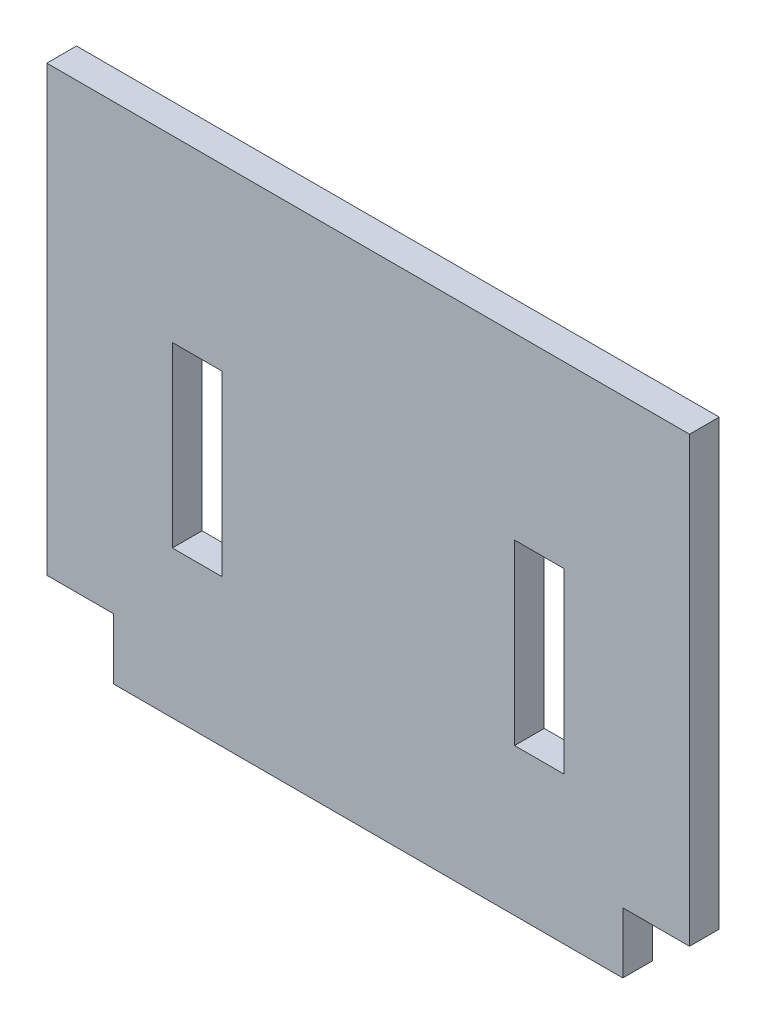
ISO-10303-21;
HEADER;
FILE_DESCRIPTION(('STEP AP214'),'2;1');
FILE_NAME('part.step','',(''),(''),'','','');
FILE_SCHEMA(('AUTOMOTIVE_DESIGN { 1 0 10303 214 1 1 1 1 }'));
ENDSEC;
DATA;
#1=APPLICATION_CONTEXT('core data for automotive mechanical design processes');
#2=APPLICATION_PROTOCOL_DEFINITION('international standard','automotive_design',2000,#1);
#3=PRODUCT_CONTEXT('',#1,'mechanical');
#4=PRODUCT('Part','Part','',(#3));
#5=PRODUCT_RELATED_PRODUCT_CATEGORY('part','',(#4));
#6=PRODUCT_DEFINITION_FORMATION('','',#4);
#7=PRODUCT_DEFINITION_CONTEXT('part definition',#1,'design');
#8=PRODUCT_DEFINITION('design','',#6,#7);
#9=PRODUCT_DEFINITION_SHAPE('','',#8);
#10=(LENGTH_UNIT() NAMED_UNIT(*) SI_UNIT(.MILLI.,.METRE.));
#11=(NAMED_UNIT(*) PLANE_ANGLE_UNIT() SI_UNIT($,.RADIAN.));
#12=(NAMED_UNIT(*) SI_UNIT($,.STERADIAN.) SOLID_ANGLE_UNIT());
#13=UNCERTAINTY_MEASURE_WITH_UNIT(LENGTH_MEASURE(1.E-05),#10,'distance_accuracy_value','');
#14=(GEOMETRIC_REPRESENTATION_CONTEXT(3) GLOBAL_UNCERTAINTY_ASSIGNED_CONTEXT((#13)) GLOBAL_UNIT_ASSIGNED_CONTEXT((#10,
#11,#12)) REPRESENTATION_CONTEXT('',''));
#15=CARTESIAN_POINT('',(0.,0.,0.));
#16=DIRECTION('',(0.,0.,1.));
#17=DIRECTION('',(1.,0.,0.));
#18=AXIS2_PLACEMENT_3D('',#15,#16,#17);
#19=CARTESIAN_POINT('',(-776.713414634147,983.740243902439,3.));
#20=DIRECTION('',(1.,0.,0.));
#21=DIRECTION('',(0.,0.,-1.));
#22=AXIS2_PLACEMENT_3D('',#19,#20,#21);
#23=PLANE('',#22);
#24=DIRECTION('',(0.,-1.,0.));
#25=VECTOR('',#24,1.);
#26=CARTESIAN_POINT('',(-776.713414634147,983.740243902439,0.));
#27=LINE('',#26,#25);
#28=CARTESIAN_POINT('',(-776.713414634147,1034.74024390244,0.));
#29=VERTEX_POINT('',#28);
#30=CARTESIAN_POINT('',(-776.713414634147,989.890243902439,0.));
#31=VERTEX_POINT('',#30);
#32=EDGE_CURVE('E269',#29,#31,#27,.T.);
#33=ORIENTED_EDGE('',*,*,#32,.T.);
#34=DIRECTION('',(0.,0.,1.));
#35=VECTOR('',#34,1.);
#36=CARTESIAN_POINT('',(-776.713414634147,989.890243902439,0.));
#37=LINE('',#36,#35);
#38=CARTESIAN_POINT('',(-776.713414634147,989.890243902439,3.));
#39=VERTEX_POINT('',#38);
#40=EDGE_CURVE('E265',#31,#39,#37,.T.);
#41=ORIENTED_EDGE('',*,*,#40,.T.);
#42=DIRECTION('',(0.,-1.,0.));
#43=VECTOR('',#42,1.);
#44=CARTESIAN_POINT('',(-776.713414634147,983.740243902439,3.));
#45=LINE('',#44,#43);
#46=CARTESIAN_POINT('',(-776.713414634147,1034.74024390244,3.));
#47=VERTEX_POINT('',#46);
#48=EDGE_CURVE('E298',#47,#39,#45,.T.);
#49=ORIENTED_EDGE('',*,*,#48,.F.);
#50=DIRECTION('',(0.,0.,-1.));
#51=VECTOR('',#50,1.);
#52=CARTESIAN_POINT('',(-776.713414634147,1034.74024390244,3.));
#53=LINE('',#52,#51);
#54=EDGE_CURVE('E51',#47,#29,#53,.T.);
#55=ORIENTED_EDGE('',*,*,#54,.T.);
#56=EDGE_LOOP('',(#33,#41,#49,#55));
#57=FACE_BOUND('',#56,.T.);
#58=ADVANCED_FACE('F43',(#57),#23,.F.);
#59=CARTESIAN_POINT('',(-776.713414634147,983.740243902439,3.));
#60=DIRECTION('',(0.,1.,0.));
#61=DIRECTION('',(-1.,0.,0.));
#62=AXIS2_PLACEMENT_3D('',#59,#60,#61);
#63=PLANE('',#62);
#64=DIRECTION('',(1.,0.,0.));
#65=VECTOR('',#64,1.);
#66=CARTESIAN_POINT('',(-776.713414634147,983.740243902439,3.));
#67=LINE('',#66,#65);
#68=CARTESIAN_POINT('',(-769.963414634146,983.740243902439,3.));
#69=VERTEX_POINT('',#68);
#70=CARTESIAN_POINT('',(-718.463414634147,983.740243902439,3.));
#71=VERTEX_POINT('',#70);
#72=EDGE_CURVE('E302',#69,#71,#67,.T.);
#73=ORIENTED_EDGE('',*,*,#72,.F.);
#74=DIRECTION('',(0.,0.,1.));
#75=VECTOR('',#74,1.);
#76=CARTESIAN_POINT('',(-769.963414634146,983.740243902439,0.));
#77=LINE('',#76,#75);
#78=CARTESIAN_POINT('',(-769.963414634146,983.740243902439,0.));
#79=VERTEX_POINT('',#78);
#80=EDGE_CURVE('E257',#79,#69,#77,.T.);
#81=ORIENTED_EDGE('',*,*,#80,.F.);
#82=DIRECTION('',(1.,0.,0.));
#83=VECTOR('',#82,1.);
#84=CARTESIAN_POINT('',(-776.713414634147,983.740243902439,0.));
#85=LINE('',#84,#83);
#86=CARTESIAN_POINT('',(-718.463414634147,983.740243902439,0.));
#87=VERTEX_POINT('',#86);
#88=EDGE_CURVE('E316',#79,#87,#85,.T.);
#89=ORIENTED_EDGE('',*,*,#88,.T.);
#90=DIRECTION('',(0.,0.,1.));
#91=VECTOR('',#90,1.);
#92=CARTESIAN_POINT('',(-718.463414634147,983.740243902439,0.));
#93=LINE('',#92,#91);
#94=EDGE_CURVE('E202',#87,#71,#93,.T.);
#95=ORIENTED_EDGE('',*,*,#94,.T.);
#96=EDGE_LOOP('',(#73,#81,#89,#95));
#97=FACE_BOUND('',#96,.T.);
#98=ADVANCED_FACE('F361',(#97),#63,.F.);
#99=CARTESIAN_POINT('',(-711.713414634147,983.740243902439,3.));
#100=DIRECTION('',(-1.,0.,0.));
#101=DIRECTION('',(0.,0.,1.));
#102=AXIS2_PLACEMENT_3D('',#99,#100,#101);
#103=PLANE('',#102);
#104=DIRECTION('',(0.,1.,0.));
#105=VECTOR('',#104,1.);
#106=CARTESIAN_POINT('',(-711.713414634147,983.740243902439,3.));
#107=LINE('',#106,#105);
#108=CARTESIAN_POINT('',(-711.713414634147,989.890243902439,3.));
#109=VERTEX_POINT('',#108);
#110=CARTESIAN_POINT('',(-711.713414634147,1034.74024390244,3.));
#111=VERTEX_POINT('',#110);
#112=EDGE_CURVE('E307',#109,#111,#107,.T.);
#113=ORIENTED_EDGE('',*,*,#112,.F.);
#114=DIRECTION('',(0.,0.,1.));
#115=VECTOR('',#114,1.);
#116=CARTESIAN_POINT('',(-711.713414634147,989.890243902439,0.));
#117=LINE('',#116,#115);
#118=CARTESIAN_POINT('',(-711.713414634147,989.890243902439,0.));
#119=VERTEX_POINT('',#118);
#120=EDGE_CURVE('E275',#119,#109,#117,.T.);
#121=ORIENTED_EDGE('',*,*,#120,.F.);
#122=DIRECTION('',(0.,1.,0.));
#123=VECTOR('',#122,1.);
#124=CARTESIAN_POINT('',(-711.713414634147,983.740243902439,0.));
#125=LINE('',#124,#123);
#126=CARTESIAN_POINT('',(-711.713414634147,1034.74024390244,0.));
#127=VERTEX_POINT('',#126);
#128=EDGE_CURVE('E320',#119,#127,#125,.T.);
#129=ORIENTED_EDGE('',*,*,#128,.T.);
#130=DIRECTION('',(0.,0.,-1.));
#131=VECTOR('',#130,1.);
#132=CARTESIAN_POINT('',(-711.713414634147,1034.74024390244,3.));
#133=LINE('',#132,#131);
#134=EDGE_CURVE('E11',#111,#127,#133,.T.);
#135=ORIENTED_EDGE('',*,*,#134,.F.);
#136=EDGE_LOOP('',(#113,#121,#129,#135));
#137=FACE_BOUND('',#136,.T.);
#138=ADVANCED_FACE('F352',(#137),#103,.F.);
#139=CARTESIAN_POINT('',(-776.713414634147,1034.74024390244,3.));
#140=DIRECTION('',(0.,-1.,0.));
#141=DIRECTION('',(0.,0.,-1.));
#142=AXIS2_PLACEMENT_3D('',#139,#140,#141);
#143=PLANE('',#142);
#144=DIRECTION('',(-1.,0.,0.));
#145=VECTOR('',#144,1.);
#146=CARTESIAN_POINT('',(-776.713414634147,1034.74024390244,0.));
#147=LINE('',#146,#145);
#148=EDGE_CURVE('E303',#127,#29,#147,.T.);
#149=ORIENTED_EDGE('',*,*,#148,.T.);
#150=ORIENTED_EDGE('',*,*,#54,.F.);
#151=DIRECTION('',(-1.,0.,0.));
#152=VECTOR('',#151,1.);
#153=CARTESIAN_POINT('',(-776.713414634147,1034.74024390244,3.));
#154=LINE('',#153,#152);
#155=EDGE_CURVE('E310',#111,#47,#154,.T.);
#156=ORIENTED_EDGE('',*,*,#155,.F.);
#157=ORIENTED_EDGE('',*,*,#134,.T.);
#158=EDGE_LOOP('',(#149,#150,#156,#157));
#159=FACE_BOUND('',#158,.T.);
#160=ADVANCED_FACE('F350',(#159),#143,.F.);
#161=CARTESIAN_POINT('',(0.,0.,3.));
#162=DIRECTION('',(0.,0.,-1.));
#163=DIRECTION('',(-1.,0.,0.));
#164=AXIS2_PLACEMENT_3D('',#161,#162,#163);
#165=PLANE('',#164);
#166=DIRECTION('',(-1.,0.,0.));
#167=VECTOR('',#166,1.);
#168=CARTESIAN_POINT('',(0.,1016.62491856167,3.));
#169=LINE('',#168,#167);
#170=CARTESIAN_POINT('',(-759.016384974895,1016.62491856167,3.));
#171=VERTEX_POINT('',#170);
#172=CARTESIAN_POINT('',(-764.016384974895,1016.62491856167,3.));
#173=VERTEX_POINT('',#172);
#174=EDGE_CURVE('E192',#171,#173,#169,.T.);
#175=ORIENTED_EDGE('',*,*,#174,.F.);
#176=DIRECTION('',(0.,1.,0.));
#177=VECTOR('',#176,1.);
#178=CARTESIAN_POINT('',(-759.016384974895,0.,3.));
#179=LINE('',#178,#177);
#180=CARTESIAN_POINT('',(-759.016384974895,998.624918561674,3.));
#181=VERTEX_POINT('',#180);
#182=EDGE_CURVE('E58',#181,#171,#179,.T.);
#183=ORIENTED_EDGE('',*,*,#182,.F.);
#184=DIRECTION('',(-1.,0.,0.));
#185=VECTOR('',#184,1.);
#186=CARTESIAN_POINT('',(0.,998.624918561674,3.));
#187=LINE('',#186,#185);
#188=CARTESIAN_POINT('',(-764.016384974895,998.624918561674,3.));
#189=VERTEX_POINT('',#188);
#190=EDGE_CURVE('E179',#181,#189,#187,.T.);
#191=ORIENTED_EDGE('',*,*,#190,.T.);
#192=DIRECTION('',(0.,1.,0.));
#193=VECTOR('',#192,1.);
#194=CARTESIAN_POINT('',(-764.016384974895,0.,3.));
#195=LINE('',#194,#193);
#196=EDGE_CURVE('E183',#189,#173,#195,.T.);
#197=ORIENTED_EDGE('',*,*,#196,.T.);
#198=EDGE_LOOP('',(#175,#183,#191,#197));
#199=FACE_BOUND('',#198,.T.);
#200=DIRECTION('',(0.,1.,0.));
#201=VECTOR('',#200,1.);
#202=CARTESIAN_POINT('',(-724.410444293397,0.,3.));
#203=LINE('',#202,#201);
#204=CARTESIAN_POINT('',(-724.410444293397,998.624918561675,3.));
#205=VERTEX_POINT('',#204);
#206=CARTESIAN_POINT('',(-724.410444293397,1016.62491856167,3.));
#207=VERTEX_POINT('',#206);
#208=EDGE_CURVE('E227',#205,#207,#203,.T.);
#209=ORIENTED_EDGE('',*,*,#208,.F.);
#210=DIRECTION('',(1.,0.,0.));
#211=VECTOR('',#210,1.);
#212=CARTESIAN_POINT('',(0.,998.624918561675,3.));
#213=LINE('',#212,#211);
#214=CARTESIAN_POINT('',(-729.410444293397,998.624918561675,3.));
#215=VERTEX_POINT('',#214);
#216=EDGE_CURVE('E66',#215,#205,#213,.T.);
#217=ORIENTED_EDGE('',*,*,#216,.F.);
#218=DIRECTION('',(0.,1.,0.));
#219=VECTOR('',#218,1.);
#220=CARTESIAN_POINT('',(-729.410444293397,0.,3.));
#221=LINE('',#220,#219);
#222=CARTESIAN_POINT('',(-729.410444293397,1016.62491856167,3.));
#223=VERTEX_POINT('',#222);
#224=EDGE_CURVE('E213',#215,#223,#221,.T.);
#225=ORIENTED_EDGE('',*,*,#224,.T.);
#226=DIRECTION('',(1.,0.,0.));
#227=VECTOR('',#226,1.);
#228=CARTESIAN_POINT('',(0.,1016.62491856167,3.));
#229=LINE('',#228,#227);
#230=EDGE_CURVE('E231',#223,#207,#229,.T.);
#231=ORIENTED_EDGE('',*,*,#230,.T.);
#232=EDGE_LOOP('',(#209,#217,#225,#231));
#233=FACE_BOUND('',#232,.T.);
#234=ORIENTED_EDGE('',*,*,#48,.T.);
#235=DIRECTION('',(-1.,0.,0.));
#236=VECTOR('',#235,1.);
#237=CARTESIAN_POINT('',(-776.713414634147,989.890243902439,3.));
#238=LINE('',#237,#236);
#239=CARTESIAN_POINT('',(-769.963414634146,989.890243902439,3.));
#240=VERTEX_POINT('',#239);
#241=EDGE_CURVE('E253',#240,#39,#238,.T.);
#242=ORIENTED_EDGE('',*,*,#241,.F.);
#243=DIRECTION('',(0.,1.,0.));
#244=VECTOR('',#243,1.);
#245=CARTESIAN_POINT('',(-769.963414634146,983.740243902439,3.));
#246=LINE('',#245,#244);
#247=EDGE_CURVE('E258',#69,#240,#246,.T.);
#248=ORIENTED_EDGE('',*,*,#247,.F.);
#249=ORIENTED_EDGE('',*,*,#72,.T.);
#250=DIRECTION('',(0.,-1.,0.));
#251=VECTOR('',#250,1.);
#252=CARTESIAN_POINT('',(-718.463414634147,983.740243902439,3.));
#253=LINE('',#252,#251);
#254=CARTESIAN_POINT('',(-718.463414634147,989.890243902439,3.));
#255=VERTEX_POINT('',#254);
#256=EDGE_CURVE('E285',#255,#71,#253,.T.);
#257=ORIENTED_EDGE('',*,*,#256,.F.);
#258=DIRECTION('',(-1.,0.,0.));
#259=VECTOR('',#258,1.);
#260=CARTESIAN_POINT('',(-711.713414634147,989.890243902439,3.));
#261=LINE('',#260,#259);
#262=EDGE_CURVE('E262',#109,#255,#261,.T.);
#263=ORIENTED_EDGE('',*,*,#262,.F.);
#264=ORIENTED_EDGE('',*,*,#112,.T.);
#265=ORIENTED_EDGE('',*,*,#155,.T.);
#266=EDGE_LOOP('',(#234,#242,#248,#249,#257,#263,#264,#265));
#267=FACE_BOUND('',#266,.T.);
#268=ADVANCED_FACE('F346',(#199,#233,#267),#165,.F.);
#269=CARTESIAN_POINT('',(0.,0.,0.));
#270=DIRECTION('',(0.,0.,-1.));
#271=DIRECTION('',(-1.,0.,0.));
#272=AXIS2_PLACEMENT_3D('',#269,#270,#271);
#273=PLANE('',#272);
#274=DIRECTION('',(0.,1.,0.));
#275=VECTOR('',#274,1.);
#276=CARTESIAN_POINT('',(-759.016384974895,0.,0.));
#277=LINE('',#276,#275);
#278=CARTESIAN_POINT('',(-759.016384974895,998.624918561674,0.));
#279=VERTEX_POINT('',#278);
#280=CARTESIAN_POINT('',(-759.016384974895,1016.62491856167,0.));
#281=VERTEX_POINT('',#280);
#282=EDGE_CURVE('E158',#279,#281,#277,.T.);
#283=ORIENTED_EDGE('',*,*,#282,.T.);
#284=DIRECTION('',(-1.,0.,0.));
#285=VECTOR('',#284,1.);
#286=CARTESIAN_POINT('',(0.,1016.62491856167,0.));
#287=LINE('',#286,#285);
#288=CARTESIAN_POINT('',(-764.016384974895,1016.62491856167,0.));
#289=VERTEX_POINT('',#288);
#290=EDGE_CURVE('E168',#281,#289,#287,.T.);
#291=ORIENTED_EDGE('',*,*,#290,.T.);
#292=DIRECTION('',(0.,1.,0.));
#293=VECTOR('',#292,1.);
#294=CARTESIAN_POINT('',(-764.016384974895,0.,0.));
#295=LINE('',#294,#293);
#296=CARTESIAN_POINT('',(-764.016384974895,998.624918561674,0.));
#297=VERTEX_POINT('',#296);
#298=EDGE_CURVE('E174',#297,#289,#295,.T.);
#299=ORIENTED_EDGE('',*,*,#298,.F.);
#300=DIRECTION('',(-1.,0.,0.));
#301=VECTOR('',#300,1.);
#302=CARTESIAN_POINT('',(0.,998.624918561674,0.));
#303=LINE('',#302,#301);
#304=EDGE_CURVE('E165',#279,#297,#303,.T.);
#305=ORIENTED_EDGE('',*,*,#304,.F.);
#306=EDGE_LOOP('',(#283,#291,#299,#305));
#307=FACE_BOUND('',#306,.T.);
#308=DIRECTION('',(1.,0.,0.));
#309=VECTOR('',#308,1.);
#310=CARTESIAN_POINT('',(0.,998.624918561675,0.));
#311=LINE('',#310,#309);
#312=CARTESIAN_POINT('',(-729.410444293397,998.624918561675,0.));
#313=VERTEX_POINT('',#312);
#314=CARTESIAN_POINT('',(-724.410444293397,998.624918561675,0.));
#315=VERTEX_POINT('',#314);
#316=EDGE_CURVE('E208',#313,#315,#311,.T.);
#317=ORIENTED_EDGE('',*,*,#316,.T.);
#318=DIRECTION('',(0.,1.,0.));
#319=VECTOR('',#318,1.);
#320=CARTESIAN_POINT('',(-724.410444293397,0.,0.));
#321=LINE('',#320,#319);
#322=CARTESIAN_POINT('',(-724.410444293397,1016.62491856167,0.));
#323=VERTEX_POINT('',#322);
#324=EDGE_CURVE('E212',#315,#323,#321,.T.);
#325=ORIENTED_EDGE('',*,*,#324,.T.);
#326=DIRECTION('',(1.,0.,0.));
#327=VECTOR('',#326,1.);
#328=CARTESIAN_POINT('',(0.,1016.62491856167,0.));
#329=LINE('',#328,#327);
#330=CARTESIAN_POINT('',(-729.410444293397,1016.62491856167,0.));
#331=VERTEX_POINT('',#330);
#332=EDGE_CURVE('E217',#331,#323,#329,.T.);
#333=ORIENTED_EDGE('',*,*,#332,.F.);
#334=DIRECTION('',(0.,1.,0.));
#335=VECTOR('',#334,1.);
#336=CARTESIAN_POINT('',(-729.410444293397,0.,0.));
#337=LINE('',#336,#335);
#338=EDGE_CURVE('E221',#313,#331,#337,.T.);
#339=ORIENTED_EDGE('',*,*,#338,.F.);
#340=EDGE_LOOP('',(#317,#325,#333,#339));
#341=FACE_BOUND('',#340,.T.);
#342=DIRECTION('',(-1.,0.,0.));
#343=VECTOR('',#342,1.);
#344=CARTESIAN_POINT('',(-776.713414634147,989.890243902439,0.));
#345=LINE('',#344,#343);
#346=CARTESIAN_POINT('',(-769.963414634146,989.890243902439,0.));
#347=VERTEX_POINT('',#346);
#348=EDGE_CURVE('E252',#347,#31,#345,.T.);
#349=ORIENTED_EDGE('',*,*,#348,.T.);
#350=ORIENTED_EDGE('',*,*,#32,.F.);
#351=ORIENTED_EDGE('',*,*,#148,.F.);
#352=ORIENTED_EDGE('',*,*,#128,.F.);
#353=DIRECTION('',(-1.,0.,0.));
#354=VECTOR('',#353,1.);
#355=CARTESIAN_POINT('',(-711.713414634147,989.890243902439,0.));
#356=LINE('',#355,#354);
#357=CARTESIAN_POINT('',(-718.463414634147,989.890243902439,0.));
#358=VERTEX_POINT('',#357);
#359=EDGE_CURVE('E288',#119,#358,#356,.T.);
#360=ORIENTED_EDGE('',*,*,#359,.T.);
#361=DIRECTION('',(0.,-1.,0.));
#362=VECTOR('',#361,1.);
#363=CARTESIAN_POINT('',(-718.463414634147,983.740243902439,0.));
#364=LINE('',#363,#362);
#365=EDGE_CURVE('E278',#358,#87,#364,.T.);
#366=ORIENTED_EDGE('',*,*,#365,.T.);
#367=ORIENTED_EDGE('',*,*,#88,.F.);
#368=DIRECTION('',(0.,1.,0.));
#369=VECTOR('',#368,1.);
#370=CARTESIAN_POINT('',(-769.963414634146,983.740243902439,0.));
#371=LINE('',#370,#369);
#372=EDGE_CURVE('E248',#79,#347,#371,.T.);
#373=ORIENTED_EDGE('',*,*,#372,.T.);
#374=EDGE_LOOP('',(#349,#350,#351,#352,#360,#366,#367,#373));
#375=FACE_BOUND('',#374,.T.);
#376=ADVANCED_FACE('F176',(#307,#341,#375),#273,.T.);
#377=CARTESIAN_POINT('',(-718.463414634147,983.740243902439,0.));
#378=DIRECTION('',(-1.,0.,0.));
#379=DIRECTION('',(0.,0.,1.));
#380=AXIS2_PLACEMENT_3D('',#377,#378,#379);
#381=PLANE('',#380);
#382=ORIENTED_EDGE('',*,*,#256,.T.);
#383=ORIENTED_EDGE('',*,*,#94,.F.);
#384=ORIENTED_EDGE('',*,*,#365,.F.);
#385=DIRECTION('',(0.,0.,1.));
#386=VECTOR('',#385,1.);
#387=CARTESIAN_POINT('',(-718.463414634147,989.890243902439,0.));
#388=LINE('',#387,#386);
#389=EDGE_CURVE('E279',#358,#255,#388,.T.);
#390=ORIENTED_EDGE('',*,*,#389,.T.);
#391=EDGE_LOOP('',(#382,#383,#384,#390));
#392=FACE_BOUND('',#391,.T.);
#393=ADVANCED_FACE('F359',(#392),#381,.F.);
#394=CARTESIAN_POINT('',(-711.713414634147,989.890243902439,0.));
#395=DIRECTION('',(0.,1.,0.));
#396=DIRECTION('',(0.,0.,1.));
#397=AXIS2_PLACEMENT_3D('',#394,#395,#396);
#398=PLANE('',#397);
#399=ORIENTED_EDGE('',*,*,#262,.T.);
#400=ORIENTED_EDGE('',*,*,#389,.F.);
#401=ORIENTED_EDGE('',*,*,#359,.F.);
#402=ORIENTED_EDGE('',*,*,#120,.T.);
#403=EDGE_LOOP('',(#399,#400,#401,#402));
#404=FACE_BOUND('',#403,.T.);
#405=ADVANCED_FACE('F356',(#404),#398,.F.);
#406=CARTESIAN_POINT('',(-776.713414634147,989.890243902439,0.));
#407=DIRECTION('',(0.,1.,0.));
#408=DIRECTION('',(0.,0.,1.));
#409=AXIS2_PLACEMENT_3D('',#406,#407,#408);
#410=PLANE('',#409);
#411=ORIENTED_EDGE('',*,*,#241,.T.);
#412=ORIENTED_EDGE('',*,*,#40,.F.);
#413=ORIENTED_EDGE('',*,*,#348,.F.);
#414=DIRECTION('',(0.,0.,1.));
#415=VECTOR('',#414,1.);
#416=CARTESIAN_POINT('',(-769.963414634146,989.890243902439,0.));
#417=LINE('',#416,#415);
#418=EDGE_CURVE('E270',#347,#240,#417,.T.);
#419=ORIENTED_EDGE('',*,*,#418,.T.);
#420=EDGE_LOOP('',(#411,#412,#413,#419));
#421=FACE_BOUND('',#420,.T.);
#422=ADVANCED_FACE('F338',(#421),#410,.F.);
#423=CARTESIAN_POINT('',(-769.963414634146,983.740243902439,0.));
#424=DIRECTION('',(1.,0.,0.));
#425=DIRECTION('',(0.,0.,-1.));
#426=AXIS2_PLACEMENT_3D('',#423,#424,#425);
#427=PLANE('',#426);
#428=ORIENTED_EDGE('',*,*,#247,.T.);
#429=ORIENTED_EDGE('',*,*,#418,.F.);
#430=ORIENTED_EDGE('',*,*,#372,.F.);
#431=ORIENTED_EDGE('',*,*,#80,.T.);
#432=EDGE_LOOP('',(#428,#429,#430,#431));
#433=FACE_BOUND('',#432,.T.);
#434=ADVANCED_FACE('F340',(#433),#427,.F.);
#435=CARTESIAN_POINT('',(0.,998.624918561675,0.));
#436=DIRECTION('',(0.,-1.,0.));
#437=DIRECTION('',(0.,0.,-1.));
#438=AXIS2_PLACEMENT_3D('',#435,#436,#437);
#439=PLANE('',#438);
#440=ORIENTED_EDGE('',*,*,#216,.T.);
#441=DIRECTION('',(0.,0.,1.));
#442=VECTOR('',#441,1.);
#443=CARTESIAN_POINT('',(-724.410444293397,998.624918561675,0.));
#444=LINE('',#443,#442);
#445=EDGE_CURVE('E224',#315,#205,#444,.T.);
#446=ORIENTED_EDGE('',*,*,#445,.F.);
#447=ORIENTED_EDGE('',*,*,#316,.F.);
#448=DIRECTION('',(0.,0.,1.));
#449=VECTOR('',#448,1.);
#450=CARTESIAN_POINT('',(-729.410444293397,998.624918561675,0.));
#451=LINE('',#450,#449);
#452=EDGE_CURVE('E193',#313,#215,#451,.T.);
#453=ORIENTED_EDGE('',*,*,#452,.T.);
#454=EDGE_LOOP('',(#440,#446,#447,#453));
#455=FACE_BOUND('',#454,.T.);
#456=ADVANCED_FACE('F382',(#455),#439,.F.);
#457=CARTESIAN_POINT('',(-729.410444293397,0.,0.));
#458=DIRECTION('',(1.,0.,0.));
#459=DIRECTION('',(0.,0.,-1.));
#460=AXIS2_PLACEMENT_3D('',#457,#458,#459);
#461=PLANE('',#460);
#462=ORIENTED_EDGE('',*,*,#224,.F.);
#463=ORIENTED_EDGE('',*,*,#452,.F.);
#464=ORIENTED_EDGE('',*,*,#338,.T.);
#465=DIRECTION('',(0.,0.,1.));
#466=VECTOR('',#465,1.);
#467=CARTESIAN_POINT('',(-729.410444293397,1016.62491856167,0.));
#468=LINE('',#467,#466);
#469=EDGE_CURVE('E240',#331,#223,#468,.T.);
#470=ORIENTED_EDGE('',*,*,#469,.T.);
#471=EDGE_LOOP('',(#462,#463,#464,#470));
#472=FACE_BOUND('',#471,.T.);
#473=ADVANCED_FACE('F387',(#472),#461,.T.);
#474=CARTESIAN_POINT('',(0.,1016.62491856167,0.));
#475=DIRECTION('',(0.,-1.,0.));
#476=DIRECTION('',(0.,0.,-1.));
#477=AXIS2_PLACEMENT_3D('',#474,#475,#476);
#478=PLANE('',#477);
#479=ORIENTED_EDGE('',*,*,#230,.F.);
#480=ORIENTED_EDGE('',*,*,#469,.F.);
#481=ORIENTED_EDGE('',*,*,#332,.T.);
#482=DIRECTION('',(0.,0.,1.));
#483=VECTOR('',#482,1.);
#484=CARTESIAN_POINT('',(-724.410444293397,1016.62491856167,0.));
#485=LINE('',#484,#483);
#486=EDGE_CURVE('E243',#323,#207,#485,.T.);
#487=ORIENTED_EDGE('',*,*,#486,.T.);
#488=EDGE_LOOP('',(#479,#480,#481,#487));
#489=FACE_BOUND('',#488,.T.);
#490=ADVANCED_FACE('F391',(#489),#478,.T.);
#491=CARTESIAN_POINT('',(-724.410444293397,0.,0.));
#492=DIRECTION('',(1.,0.,0.));
#493=DIRECTION('',(0.,0.,-1.));
#494=AXIS2_PLACEMENT_3D('',#491,#492,#493);
#495=PLANE('',#494);
#496=ORIENTED_EDGE('',*,*,#208,.T.);
#497=ORIENTED_EDGE('',*,*,#486,.F.);
#498=ORIENTED_EDGE('',*,*,#324,.F.);
#499=ORIENTED_EDGE('',*,*,#445,.T.);
#500=EDGE_LOOP('',(#496,#497,#498,#499));
#501=FACE_BOUND('',#500,.T.);
#502=ADVANCED_FACE('F388',(#501),#495,.F.);
#503=CARTESIAN_POINT('',(-759.016384974895,0.,0.));
#504=DIRECTION('',(1.,0.,0.));
#505=DIRECTION('',(0.,0.,-1.));
#506=AXIS2_PLACEMENT_3D('',#503,#504,#505);
#507=PLANE('',#506);
#508=ORIENTED_EDGE('',*,*,#182,.T.);
#509=DIRECTION('',(0.,0.,1.));
#510=VECTOR('',#509,1.);
#511=CARTESIAN_POINT('',(-759.016384974895,1016.62491856167,0.));
#512=LINE('',#511,#510);
#513=EDGE_CURVE('E154',#281,#171,#512,.T.);
#514=ORIENTED_EDGE('',*,*,#513,.F.);
#515=ORIENTED_EDGE('',*,*,#282,.F.);
#516=DIRECTION('',(0.,0.,1.));
#517=VECTOR('',#516,1.);
#518=CARTESIAN_POINT('',(-759.016384974895,998.624918561674,0.));
#519=LINE('',#518,#517);
#520=EDGE_CURVE('E199',#279,#181,#519,.T.);
#521=ORIENTED_EDGE('',*,*,#520,.T.);
#522=EDGE_LOOP('',(#508,#514,#515,#521));
#523=FACE_BOUND('',#522,.T.);
#524=ADVANCED_FACE('F156',(#523),#507,.F.);
#525=CARTESIAN_POINT('',(0.,998.624918561674,0.));
#526=DIRECTION('',(0.,1.,0.));
#527=DIRECTION('',(0.,0.,1.));
#528=AXIS2_PLACEMENT_3D('',#525,#526,#527);
#529=PLANE('',#528);
#530=ORIENTED_EDGE('',*,*,#190,.F.);
#531=ORIENTED_EDGE('',*,*,#520,.F.);
#532=ORIENTED_EDGE('',*,*,#304,.T.);
#533=DIRECTION('',(0.,0.,1.));
#534=VECTOR('',#533,1.);
#535=CARTESIAN_POINT('',(-764.016384974895,998.624918561674,0.));
#536=LINE('',#535,#534);
#537=EDGE_CURVE('E203',#297,#189,#536,.T.);
#538=ORIENTED_EDGE('',*,*,#537,.T.);
#539=EDGE_LOOP('',(#530,#531,#532,#538));
#540=FACE_BOUND('',#539,.T.);
#541=ADVANCED_FACE('F401',(#540),#529,.T.);
#542=CARTESIAN_POINT('',(-764.016384974895,0.,0.));
#543=DIRECTION('',(1.,0.,0.));
#544=DIRECTION('',(0.,0.,-1.));
#545=AXIS2_PLACEMENT_3D('',#542,#543,#544);
#546=PLANE('',#545);
#547=ORIENTED_EDGE('',*,*,#196,.F.);
#548=ORIENTED_EDGE('',*,*,#537,.F.);
#549=ORIENTED_EDGE('',*,*,#298,.T.);
#550=DIRECTION('',(0.,0.,1.));
#551=VECTOR('',#550,1.);
#552=CARTESIAN_POINT('',(-764.016384974895,1016.62491856167,0.));
#553=LINE('',#552,#551);
#554=EDGE_CURVE('E164',#289,#173,#553,.T.);
#555=ORIENTED_EDGE('',*,*,#554,.T.);
#556=EDGE_LOOP('',(#547,#548,#549,#555));
#557=FACE_BOUND('',#556,.T.);
#558=ADVANCED_FACE('F404',(#557),#546,.T.);
#559=CARTESIAN_POINT('',(0.,1016.62491856167,0.));
#560=DIRECTION('',(0.,1.,0.));
#561=DIRECTION('',(0.,0.,1.));
#562=AXIS2_PLACEMENT_3D('',#559,#560,#561);
#563=PLANE('',#562);
#564=ORIENTED_EDGE('',*,*,#174,.T.);
#565=ORIENTED_EDGE('',*,*,#554,.F.);
#566=ORIENTED_EDGE('',*,*,#290,.F.);
#567=ORIENTED_EDGE('',*,*,#513,.T.);
#568=EDGE_LOOP('',(#564,#565,#566,#567));
#569=FACE_BOUND('',#568,.T.);
#570=ADVANCED_FACE('F169',(#569),#563,.F.);
#571=CLOSED_SHELL('',(#58,#98,#138,#160,#268,#376,#393,#405,#422,#434,#456,#473,#490,#502,#524,
#541,#558,#570));
#572=MANIFOLD_SOLID_BREP('B2',#571);
#573=ADVANCED_BREP_SHAPE_REPRESENTATION('',(#18,#572),#14);
#574=SHAPE_DEFINITION_REPRESENTATION(#9,#573);
ENDSEC;
END-ISO-10303-21;
